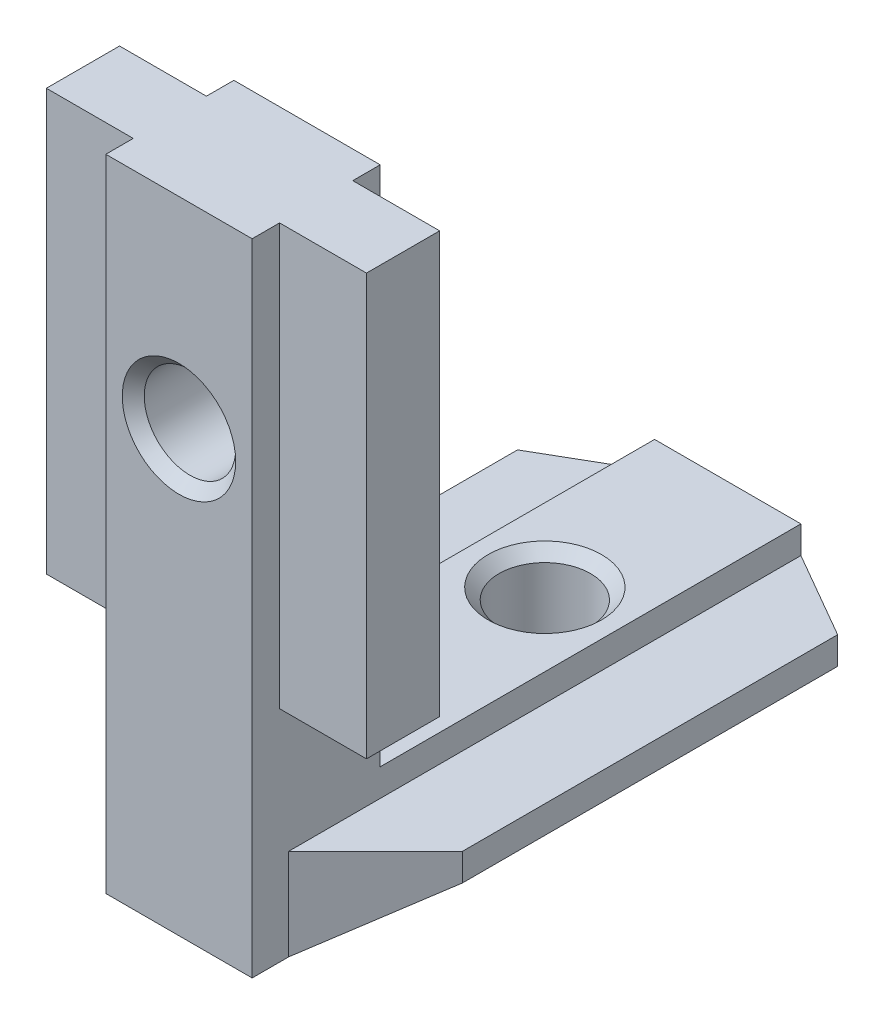
ISO-10303-21;
HEADER;
FILE_DESCRIPTION(('STEP AP214'),'2;1');
FILE_NAME('part.step','',(''),(''),'','','');
FILE_SCHEMA(('AUTOMOTIVE_DESIGN { 1 0 10303 214 1 1 1 1 }'));
ENDSEC;
DATA;
#1=APPLICATION_CONTEXT('core data for automotive mechanical design processes');
#2=APPLICATION_PROTOCOL_DEFINITION('international standard','automotive_design',2000,#1);
#3=PRODUCT_CONTEXT('',#1,'mechanical');
#4=PRODUCT('Part','Part','',(#3));
#5=PRODUCT_RELATED_PRODUCT_CATEGORY('part','',(#4));
#6=PRODUCT_DEFINITION_FORMATION('','',#4);
#7=PRODUCT_DEFINITION_CONTEXT('part definition',#1,'design');
#8=PRODUCT_DEFINITION('design','',#6,#7);
#9=PRODUCT_DEFINITION_SHAPE('','',#8);
#10=(LENGTH_UNIT() NAMED_UNIT(*) SI_UNIT(.MILLI.,.METRE.));
#11=(NAMED_UNIT(*) PLANE_ANGLE_UNIT() SI_UNIT($,.RADIAN.));
#12=(NAMED_UNIT(*) SI_UNIT($,.STERADIAN.) SOLID_ANGLE_UNIT());
#13=UNCERTAINTY_MEASURE_WITH_UNIT(LENGTH_MEASURE(1.E-05),#10,'distance_accuracy_value','');
#14=(GEOMETRIC_REPRESENTATION_CONTEXT(3) GLOBAL_UNCERTAINTY_ASSIGNED_CONTEXT((#13)) GLOBAL_UNIT_ASSIGNED_CONTEXT((#10,
#11,#12)) REPRESENTATION_CONTEXT('',''));
#15=CARTESIAN_POINT('',(0.,0.,0.));
#16=DIRECTION('',(0.,0.,1.));
#17=DIRECTION('',(1.,0.,0.));
#18=AXIS2_PLACEMENT_3D('',#15,#16,#17);
#19=CARTESIAN_POINT('',(4.,0.,30.));
#20=DIRECTION('',(0.,-1.,0.));
#21=DIRECTION('',(0.,0.,-1.));
#22=AXIS2_PLACEMENT_3D('',#19,#20,#21);
#23=PLANE('',#22);
#24=CARTESIAN_POINT('',(0.,0.,10.));
#25=DIRECTION('',(0.,-1.,0.));
#26=DIRECTION('',(0.,0.,-1.));
#27=AXIS2_PLACEMENT_3D('',#24,#25,#26);
#28=CIRCLE('',#27,3.1);
#29=CARTESIAN_POINT('',(0.,0.,6.9));
#30=VERTEX_POINT('',#29);
#31=EDGE_CURVE('E672',#30,#30,#28,.T.);
#32=ORIENTED_EDGE('',*,*,#31,.T.);
#33=EDGE_LOOP('',(#32));
#34=FACE_BOUND('',#33,.T.);
#35=DIRECTION('',(-1.,0.,0.));
#36=VECTOR('',#35,1.);
#37=CARTESIAN_POINT('',(4.,0.,23.));
#38=LINE('',#37,#36);
#39=CARTESIAN_POINT('',(4.,0.,23.));
#40=VERTEX_POINT('',#39);
#41=CARTESIAN_POINT('',(-4.,0.,23.));
#42=VERTEX_POINT('',#41);
#43=EDGE_CURVE('E341',#40,#42,#38,.T.);
#44=ORIENTED_EDGE('',*,*,#43,.F.);
#45=DIRECTION('',(0.,0.,-1.));
#46=VECTOR('',#45,1.);
#47=CARTESIAN_POINT('',(4.,0.,30.));
#48=LINE('',#47,#46);
#49=CARTESIAN_POINT('',(4.,0.,0.));
#50=VERTEX_POINT('',#49);
#51=EDGE_CURVE('E313',#40,#50,#48,.T.);
#52=ORIENTED_EDGE('',*,*,#51,.T.);
#53=DIRECTION('',(-1.,0.,0.));
#54=VECTOR('',#53,1.);
#55=CARTESIAN_POINT('',(4.,0.,0.));
#56=LINE('',#55,#54);
#57=CARTESIAN_POINT('',(-4.,0.,0.));
#58=VERTEX_POINT('',#57);
#59=EDGE_CURVE('E295',#50,#58,#56,.T.);
#60=ORIENTED_EDGE('',*,*,#59,.T.);
#61=DIRECTION('',(0.,0.,-1.));
#62=VECTOR('',#61,1.);
#63=CARTESIAN_POINT('',(-4.,0.,30.));
#64=LINE('',#63,#62);
#65=EDGE_CURVE('E301',#42,#58,#64,.T.);
#66=ORIENTED_EDGE('',*,*,#65,.F.);
#67=EDGE_LOOP('',(#44,#52,#60,#66));
#68=FACE_BOUND('',#67,.T.);
#69=ADVANCED_FACE('F36',(#34,#68),#23,.F.);
#70=CARTESIAN_POINT('',(-4.,0.,30.));
#71=DIRECTION('',(1.,0.,0.));
#72=DIRECTION('',(0.,0.,-1.));
#73=AXIS2_PLACEMENT_3D('',#70,#71,#72);
#74=PLANE('',#73);
#75=DIRECTION('',(0.,0.,1.));
#76=VECTOR('',#75,1.);
#77=CARTESIAN_POINT('',(-4.,28.5,30.));
#78=LINE('',#77,#76);
#79=CARTESIAN_POINT('',(-4.,28.5,28.5));
#80=VERTEX_POINT('',#79);
#81=CARTESIAN_POINT('',(-4.,28.5,30.));
#82=VERTEX_POINT('',#81);
#83=EDGE_CURVE('E283',#80,#82,#78,.T.);
#84=ORIENTED_EDGE('',*,*,#83,.F.);
#85=DIRECTION('',(0.,-1.,0.));
#86=VECTOR('',#85,1.);
#87=CARTESIAN_POINT('',(-4.,0.,28.5));
#88=LINE('',#87,#86);
#89=CARTESIAN_POINT('',(-4.,5.50000000000001,28.5));
#90=VERTEX_POINT('',#89);
#91=EDGE_CURVE('E232',#80,#90,#88,.T.);
#92=ORIENTED_EDGE('',*,*,#91,.T.);
#93=DIRECTION('',(0.,0.,1.));
#94=VECTOR('',#93,1.);
#95=CARTESIAN_POINT('',(-4.,5.50000000000001,30.));
#96=LINE('',#95,#94);
#97=CARTESIAN_POINT('',(-4.,5.50000000000001,24.5));
#98=VERTEX_POINT('',#97);
#99=EDGE_CURVE('E235',#98,#90,#96,.T.);
#100=ORIENTED_EDGE('',*,*,#99,.F.);
#101=DIRECTION('',(0.,1.,0.));
#102=VECTOR('',#101,1.);
#103=CARTESIAN_POINT('',(-4.,0.,24.5));
#104=LINE('',#103,#102);
#105=CARTESIAN_POINT('',(-4.,28.5,24.5));
#106=VERTEX_POINT('',#105);
#107=EDGE_CURVE('E227',#98,#106,#104,.T.);
#108=ORIENTED_EDGE('',*,*,#107,.T.);
#109=CARTESIAN_POINT('',(-4.,28.5,23.));
#110=VERTEX_POINT('',#109);
#111=EDGE_CURVE('E278',#110,#106,#78,.T.);
#112=ORIENTED_EDGE('',*,*,#111,.F.);
#113=DIRECTION('',(0.,1.,0.));
#114=VECTOR('',#113,1.);
#115=CARTESIAN_POINT('',(-4.,28.5,23.));
#116=LINE('',#115,#114);
#117=EDGE_CURVE('E274',#42,#110,#116,.T.);
#118=ORIENTED_EDGE('',*,*,#117,.F.);
#119=ORIENTED_EDGE('',*,*,#65,.T.);
#120=DIRECTION('',(0.,-1.,0.));
#121=VECTOR('',#120,1.);
#122=CARTESIAN_POINT('',(-4.,0.,0.));
#123=LINE('',#122,#121);
#124=CARTESIAN_POINT('',(-4.,-1.5,0.));
#125=VERTEX_POINT('',#124);
#126=EDGE_CURVE('E291',#58,#125,#123,.T.);
#127=ORIENTED_EDGE('',*,*,#126,.T.);
#128=DIRECTION('',(0.,0.,-1.));
#129=VECTOR('',#128,1.);
#130=CARTESIAN_POINT('',(-4.,-1.5,30.));
#131=LINE('',#130,#129);
#132=CARTESIAN_POINT('',(-4.,-1.5,28.));
#133=VERTEX_POINT('',#132);
#134=EDGE_CURVE('E338',#133,#125,#131,.T.);
#135=ORIENTED_EDGE('',*,*,#134,.F.);
#136=DIRECTION('',(0.,1.,0.));
#137=VECTOR('',#136,1.);
#138=CARTESIAN_POINT('',(-4.,-6.5,28.));
#139=LINE('',#138,#137);
#140=CARTESIAN_POINT('',(-4.,-6.5,28.));
#141=VERTEX_POINT('',#140);
#142=EDGE_CURVE('E240',#141,#133,#139,.T.);
#143=ORIENTED_EDGE('',*,*,#142,.F.);
#144=DIRECTION('',(0.,0.,-1.));
#145=VECTOR('',#144,1.);
#146=CARTESIAN_POINT('',(-4.,-6.5,30.));
#147=LINE('',#146,#145);
#148=CARTESIAN_POINT('',(-4.,-6.5,30.));
#149=VERTEX_POINT('',#148);
#150=EDGE_CURVE('E329',#149,#141,#147,.T.);
#151=ORIENTED_EDGE('',*,*,#150,.F.);
#152=DIRECTION('',(0.,-1.,0.));
#153=VECTOR('',#152,1.);
#154=CARTESIAN_POINT('',(-4.,0.,30.));
#155=LINE('',#154,#153);
#156=EDGE_CURVE('E292',#82,#149,#155,.T.);
#157=ORIENTED_EDGE('',*,*,#156,.F.);
#158=EDGE_LOOP('',(#84,#92,#100,#108,#112,#118,#119,#127,#135,#143,#151,#157));
#159=FACE_BOUND('',#158,.T.);
#160=ADVANCED_FACE('F38',(#159),#74,.F.);
#161=CARTESIAN_POINT('',(-4.,-1.5,30.));
#162=DIRECTION('',(0.,-1.,0.));
#163=DIRECTION('',(1.,0.,0.));
#164=AXIS2_PLACEMENT_3D('',#161,#162,#163);
#165=PLANE('',#164);
#166=DIRECTION('',(0.,0.,-1.));
#167=VECTOR('',#166,1.);
#168=CARTESIAN_POINT('',(-8.75,-1.5,30.));
#169=LINE('',#168,#167);
#170=CARTESIAN_POINT('',(-8.75,-1.5,23.25));
#171=VERTEX_POINT('',#170);
#172=CARTESIAN_POINT('',(-8.75,-1.5,2.74241377865068));
#173=VERTEX_POINT('',#172);
#174=EDGE_CURVE('E335',#171,#173,#169,.T.);
#175=ORIENTED_EDGE('',*,*,#174,.F.);
#176=DIRECTION('',(-0.707106781186549,0.,-0.707106781186546));
#177=VECTOR('',#176,1.);
#178=CARTESIAN_POINT('',(-4.,-1.5,28.));
#179=LINE('',#178,#177);
#180=EDGE_CURVE('E238',#133,#171,#179,.T.);
#181=ORIENTED_EDGE('',*,*,#180,.F.);
#182=ORIENTED_EDGE('',*,*,#134,.T.);
#183=DIRECTION('',(0.866025403784442,0.,-0.499999999999995));
#184=VECTOR('',#183,1.);
#185=CARTESIAN_POINT('',(-4.,-1.5,0.));
#186=LINE('',#185,#184);
#187=EDGE_CURVE('E245',#173,#125,#186,.T.);
#188=ORIENTED_EDGE('',*,*,#187,.F.);
#189=EDGE_LOOP('',(#175,#181,#182,#188));
#190=FACE_BOUND('',#189,.T.);
#191=ADVANCED_FACE('F359',(#190),#165,.F.);
#192=CARTESIAN_POINT('',(-8.75,-1.5,30.));
#193=DIRECTION('',(1.,0.,0.));
#194=DIRECTION('',(0.,0.,-1.));
#195=AXIS2_PLACEMENT_3D('',#192,#193,#194);
#196=PLANE('',#195);
#197=DIRECTION('',(0.,0.,-1.));
#198=VECTOR('',#197,1.);
#199=CARTESIAN_POINT('',(-8.75,-3.,30.));
#200=LINE('',#199,#198);
#201=CARTESIAN_POINT('',(-8.75,-3.,23.25));
#202=VERTEX_POINT('',#201);
#203=CARTESIAN_POINT('',(-8.75,-3.,2.74241377865068));
#204=VERTEX_POINT('',#203);
#205=EDGE_CURVE('E332',#202,#204,#200,.T.);
#206=ORIENTED_EDGE('',*,*,#205,.F.);
#207=DIRECTION('',(0.,1.,0.));
#208=VECTOR('',#207,1.);
#209=CARTESIAN_POINT('',(-8.75,-6.5,23.25));
#210=LINE('',#209,#208);
#211=EDGE_CURVE('E242',#202,#171,#210,.T.);
#212=ORIENTED_EDGE('',*,*,#211,.T.);
#213=ORIENTED_EDGE('',*,*,#174,.T.);
#214=DIRECTION('',(0.,1.,0.));
#215=VECTOR('',#214,1.);
#216=CARTESIAN_POINT('',(-8.75,-6.5,2.74241377865068));
#217=LINE('',#216,#215);
#218=EDGE_CURVE('E260',#204,#173,#217,.T.);
#219=ORIENTED_EDGE('',*,*,#218,.F.);
#220=EDGE_LOOP('',(#206,#212,#213,#219));
#221=FACE_BOUND('',#220,.T.);
#222=ADVANCED_FACE('F353',(#221),#196,.F.);
#223=CARTESIAN_POINT('',(-8.75,-3.,30.));
#224=DIRECTION('',(0.59319903804985,0.805055837353368,0.));
#225=DIRECTION('',(-0.805055837353368,0.59319903804985,0.));
#226=AXIS2_PLACEMENT_3D('',#223,#224,#225);
#227=PLANE('',#226);
#228=CARTESIAN_POINT('',(-4.,-6.5,0.));
#229=VERTEX_POINT('',#228);
#230=EDGE_CURVE('E328',#141,#229,#147,.T.);
#231=ORIENTED_EDGE('',*,*,#230,.F.);
#232=DIRECTION('',(-0.627093443885228,0.462068853389115,-0.627093443885226));
#233=VECTOR('',#232,1.);
#234=CARTESIAN_POINT('',(-6.09558823529412,-4.95588235294117,25.9044117647059));
#235=LINE('',#234,#233);
#236=EDGE_CURVE('E44',#141,#202,#235,.T.);
#237=ORIENTED_EDGE('',*,*,#236,.T.);
#238=ORIENTED_EDGE('',*,*,#205,.T.);
#239=DIRECTION('',(0.73004961539945,-0.537931295557489,-0.421494341972649));
#240=VECTOR('',#239,1.);
#241=CARTESIAN_POINT('',(-17.1374804360093,3.18024874232261,7.58492786620328));
#242=LINE('',#241,#240);
#243=EDGE_CURVE('E264',#204,#229,#242,.T.);
#244=ORIENTED_EDGE('',*,*,#243,.T.);
#245=EDGE_LOOP('',(#231,#237,#238,#244));
#246=FACE_BOUND('',#245,.T.);
#247=ADVANCED_FACE('F347',(#246),#227,.F.);
#248=CARTESIAN_POINT('',(-4.,-6.5,30.));
#249=DIRECTION('',(0.,1.,0.));
#250=DIRECTION('',(0.,0.,1.));
#251=AXIS2_PLACEMENT_3D('',#248,#249,#250);
#252=PLANE('',#251);
#253=CARTESIAN_POINT('',(0.,-6.5,10.));
#254=DIRECTION('',(0.,-1.,0.));
#255=DIRECTION('',(0.,0.,-1.));
#256=AXIS2_PLACEMENT_3D('',#253,#254,#255);
#257=CIRCLE('',#256,3.1);
#258=CARTESIAN_POINT('',(0.,-6.5,6.9));
#259=VERTEX_POINT('',#258);
#260=EDGE_CURVE('E674',#259,#259,#257,.T.);
#261=ORIENTED_EDGE('',*,*,#260,.F.);
#262=EDGE_LOOP('',(#261));
#263=FACE_BOUND('',#262,.T.);
#264=ORIENTED_EDGE('',*,*,#150,.T.);
#265=ORIENTED_EDGE('',*,*,#230,.T.);
#266=DIRECTION('',(1.,0.,0.));
#267=VECTOR('',#266,1.);
#268=CARTESIAN_POINT('',(-4.,-6.5,0.));
#269=LINE('',#268,#267);
#270=CARTESIAN_POINT('',(4.,-6.5,0.));
#271=VERTEX_POINT('',#270);
#272=EDGE_CURVE('E304',#229,#271,#269,.T.);
#273=ORIENTED_EDGE('',*,*,#272,.T.);
#274=DIRECTION('',(0.,0.,-1.));
#275=VECTOR('',#274,1.);
#276=CARTESIAN_POINT('',(4.,-6.5,30.));
#277=LINE('',#276,#275);
#278=CARTESIAN_POINT('',(4.,-6.5,28.));
#279=VERTEX_POINT('',#278);
#280=EDGE_CURVE('E324',#279,#271,#277,.T.);
#281=ORIENTED_EDGE('',*,*,#280,.F.);
#282=CARTESIAN_POINT('',(4.,-6.5,30.));
#283=VERTEX_POINT('',#282);
#284=EDGE_CURVE('E325',#283,#279,#277,.T.);
#285=ORIENTED_EDGE('',*,*,#284,.F.);
#286=DIRECTION('',(1.,0.,0.));
#287=VECTOR('',#286,1.);
#288=CARTESIAN_POINT('',(-4.,-6.5,30.));
#289=LINE('',#288,#287);
#290=EDGE_CURVE('E294',#149,#283,#289,.T.);
#291=ORIENTED_EDGE('',*,*,#290,.F.);
#292=EDGE_LOOP('',(#264,#265,#273,#281,#285,#291));
#293=FACE_BOUND('',#292,.T.);
#294=ADVANCED_FACE('F395',(#263,#293),#252,.F.);
#295=CARTESIAN_POINT('',(8.75,-3.,30.));
#296=DIRECTION('',(-0.59319903804985,0.805055837353368,0.));
#297=DIRECTION('',(-0.805055837353368,-0.59319903804985,0.));
#298=AXIS2_PLACEMENT_3D('',#295,#296,#297);
#299=PLANE('',#298);
#300=ORIENTED_EDGE('',*,*,#280,.T.);
#301=DIRECTION('',(0.73004961539945,0.537931295557489,0.421494341972649));
#302=VECTOR('',#301,1.);
#303=CARTESIAN_POINT('',(17.1374804360093,3.18024874232261,7.58492786620327));
#304=LINE('',#303,#302);
#305=CARTESIAN_POINT('',(8.75,-3.,2.74241377865068));
#306=VERTEX_POINT('',#305);
#307=EDGE_CURVE('E268',#271,#306,#304,.T.);
#308=ORIENTED_EDGE('',*,*,#307,.T.);
#309=DIRECTION('',(0.,0.,-1.));
#310=VECTOR('',#309,1.);
#311=CARTESIAN_POINT('',(8.75,-3.,30.));
#312=LINE('',#311,#310);
#313=CARTESIAN_POINT('',(8.75000000000001,-3.,23.25));
#314=VERTEX_POINT('',#313);
#315=EDGE_CURVE('E321',#314,#306,#312,.T.);
#316=ORIENTED_EDGE('',*,*,#315,.F.);
#317=DIRECTION('',(-0.627093443885228,-0.462068853389116,0.627093443885225));
#318=VECTOR('',#317,1.);
#319=CARTESIAN_POINT('',(6.09558823529413,-4.95588235294117,25.9044117647059));
#320=LINE('',#319,#318);
#321=EDGE_CURVE('E271',#314,#279,#320,.T.);
#322=ORIENTED_EDGE('',*,*,#321,.T.);
#323=EDGE_LOOP('',(#300,#308,#316,#322));
#324=FACE_BOUND('',#323,.T.);
#325=ADVANCED_FACE('F391',(#324),#299,.F.);
#326=CARTESIAN_POINT('',(8.75,-1.5,30.));
#327=DIRECTION('',(-1.,0.,0.));
#328=DIRECTION('',(0.,0.,1.));
#329=AXIS2_PLACEMENT_3D('',#326,#327,#328);
#330=PLANE('',#329);
#331=ORIENTED_EDGE('',*,*,#315,.T.);
#332=DIRECTION('',(0.,1.,0.));
#333=VECTOR('',#332,1.);
#334=CARTESIAN_POINT('',(8.75,-6.5,2.74241377865068));
#335=LINE('',#334,#333);
#336=CARTESIAN_POINT('',(8.75,-1.5,2.74241377865068));
#337=VERTEX_POINT('',#336);
#338=EDGE_CURVE('E251',#306,#337,#335,.T.);
#339=ORIENTED_EDGE('',*,*,#338,.T.);
#340=DIRECTION('',(0.,0.,-1.));
#341=VECTOR('',#340,1.);
#342=CARTESIAN_POINT('',(8.75,-1.5,30.));
#343=LINE('',#342,#341);
#344=CARTESIAN_POINT('',(8.75000000000001,-1.5,23.25));
#345=VERTEX_POINT('',#344);
#346=EDGE_CURVE('E318',#345,#337,#343,.T.);
#347=ORIENTED_EDGE('',*,*,#346,.F.);
#348=DIRECTION('',(0.,1.,0.));
#349=VECTOR('',#348,1.);
#350=CARTESIAN_POINT('',(8.75000000000001,-6.5,23.25));
#351=LINE('',#350,#349);
#352=EDGE_CURVE('E250',#314,#345,#351,.T.);
#353=ORIENTED_EDGE('',*,*,#352,.F.);
#354=EDGE_LOOP('',(#331,#339,#347,#353));
#355=FACE_BOUND('',#354,.T.);
#356=ADVANCED_FACE('F386',(#355),#330,.F.);
#357=CARTESIAN_POINT('',(4.,-1.5,30.));
#358=DIRECTION('',(0.,-1.,0.));
#359=DIRECTION('',(1.,0.,0.));
#360=AXIS2_PLACEMENT_3D('',#357,#358,#359);
#361=PLANE('',#360);
#362=ORIENTED_EDGE('',*,*,#346,.T.);
#363=DIRECTION('',(0.866025403784442,0.,0.499999999999994));
#364=VECTOR('',#363,1.);
#365=CARTESIAN_POINT('',(4.,-1.5,0.));
#366=LINE('',#365,#364);
#367=CARTESIAN_POINT('',(4.,-1.5,0.));
#368=VERTEX_POINT('',#367);
#369=EDGE_CURVE('E237',#368,#337,#366,.T.);
#370=ORIENTED_EDGE('',*,*,#369,.F.);
#371=DIRECTION('',(0.,0.,-1.));
#372=VECTOR('',#371,1.);
#373=CARTESIAN_POINT('',(4.,-1.5,30.));
#374=LINE('',#373,#372);
#375=CARTESIAN_POINT('',(4.,-1.5,28.));
#376=VERTEX_POINT('',#375);
#377=EDGE_CURVE('E315',#376,#368,#374,.T.);
#378=ORIENTED_EDGE('',*,*,#377,.F.);
#379=DIRECTION('',(-0.707106781186549,0.,0.707106781186546));
#380=VECTOR('',#379,1.);
#381=CARTESIAN_POINT('',(4.,-1.5,28.));
#382=LINE('',#381,#380);
#383=EDGE_CURVE('E247',#345,#376,#382,.T.);
#384=ORIENTED_EDGE('',*,*,#383,.F.);
#385=EDGE_LOOP('',(#362,#370,#378,#384));
#386=FACE_BOUND('',#385,.T.);
#387=ADVANCED_FACE('F381',(#386),#361,.F.);
#388=CARTESIAN_POINT('',(4.,0.,30.));
#389=DIRECTION('',(-1.,0.,0.));
#390=DIRECTION('',(0.,0.,1.));
#391=AXIS2_PLACEMENT_3D('',#388,#389,#390);
#392=PLANE('',#391);
#393=DIRECTION('',(0.,0.,-1.));
#394=VECTOR('',#393,1.);
#395=CARTESIAN_POINT('',(4.,5.50000000000001,30.));
#396=LINE('',#395,#394);
#397=CARTESIAN_POINT('',(4.,5.50000000000001,28.5));
#398=VERTEX_POINT('',#397);
#399=CARTESIAN_POINT('',(4.,5.50000000000001,24.5));
#400=VERTEX_POINT('',#399);
#401=EDGE_CURVE('E11',#398,#400,#396,.T.);
#402=ORIENTED_EDGE('',*,*,#401,.F.);
#403=DIRECTION('',(0.,1.,0.));
#404=VECTOR('',#403,1.);
#405=CARTESIAN_POINT('',(4.,0.,28.5));
#406=LINE('',#405,#404);
#407=CARTESIAN_POINT('',(4.,28.5,28.5));
#408=VERTEX_POINT('',#407);
#409=EDGE_CURVE('E230',#398,#408,#406,.T.);
#410=ORIENTED_EDGE('',*,*,#409,.T.);
#411=DIRECTION('',(0.,0.,1.));
#412=VECTOR('',#411,1.);
#413=CARTESIAN_POINT('',(4.,28.5,30.));
#414=LINE('',#413,#412);
#415=CARTESIAN_POINT('',(4.,28.5,30.));
#416=VERTEX_POINT('',#415);
#417=EDGE_CURVE('E277',#408,#416,#414,.T.);
#418=ORIENTED_EDGE('',*,*,#417,.T.);
#419=DIRECTION('',(0.,1.,0.));
#420=VECTOR('',#419,1.);
#421=CARTESIAN_POINT('',(4.,0.,30.));
#422=LINE('',#421,#420);
#423=EDGE_CURVE('E298',#283,#416,#422,.T.);
#424=ORIENTED_EDGE('',*,*,#423,.F.);
#425=ORIENTED_EDGE('',*,*,#284,.T.);
#426=DIRECTION('',(0.,1.,0.));
#427=VECTOR('',#426,1.);
#428=CARTESIAN_POINT('',(4.,-6.5,28.));
#429=LINE('',#428,#427);
#430=EDGE_CURVE('E241',#279,#376,#429,.T.);
#431=ORIENTED_EDGE('',*,*,#430,.T.);
#432=ORIENTED_EDGE('',*,*,#377,.T.);
#433=DIRECTION('',(0.,1.,0.));
#434=VECTOR('',#433,1.);
#435=CARTESIAN_POINT('',(4.,0.,0.));
#436=LINE('',#435,#434);
#437=EDGE_CURVE('E307',#368,#50,#436,.T.);
#438=ORIENTED_EDGE('',*,*,#437,.T.);
#439=ORIENTED_EDGE('',*,*,#51,.F.);
#440=DIRECTION('',(0.,1.,0.));
#441=VECTOR('',#440,1.);
#442=CARTESIAN_POINT('',(4.,28.5,23.));
#443=LINE('',#442,#441);
#444=CARTESIAN_POINT('',(4.,28.5,23.));
#445=VERTEX_POINT('',#444);
#446=EDGE_CURVE('E275',#40,#445,#443,.T.);
#447=ORIENTED_EDGE('',*,*,#446,.T.);
#448=CARTESIAN_POINT('',(4.,28.5,24.5));
#449=VERTEX_POINT('',#448);
#450=EDGE_CURVE('E279',#445,#449,#414,.T.);
#451=ORIENTED_EDGE('',*,*,#450,.T.);
#452=DIRECTION('',(0.,-1.,0.));
#453=VECTOR('',#452,1.);
#454=CARTESIAN_POINT('',(4.,0.,24.5));
#455=LINE('',#454,#453);
#456=EDGE_CURVE('E51',#449,#400,#455,.T.);
#457=ORIENTED_EDGE('',*,*,#456,.T.);
#458=EDGE_LOOP('',(#402,#410,#418,#424,#425,#431,#432,#438,#439,#447,#451,#457));
#459=FACE_BOUND('',#458,.T.);
#460=ADVANCED_FACE('F376',(#459),#392,.F.);
#461=CARTESIAN_POINT('',(0.,0.,30.));
#462=DIRECTION('',(0.,0.,-1.));
#463=DIRECTION('',(-1.,0.,0.));
#464=AXIS2_PLACEMENT_3D('',#461,#462,#463);
#465=PLANE('',#464);
#466=CARTESIAN_POINT('',(0.,17.5,30.));
#467=DIRECTION('',(0.,0.,1.));
#468=DIRECTION('',(1.,0.,0.));
#469=AXIS2_PLACEMENT_3D('',#466,#467,#468);
#470=CIRCLE('',#469,3.1);
#471=CARTESIAN_POINT('',(3.1,17.5,30.));
#472=VERTEX_POINT('',#471);
#473=EDGE_CURVE('E662',#472,#472,#470,.T.);
#474=ORIENTED_EDGE('',*,*,#473,.F.);
#475=EDGE_LOOP('',(#474));
#476=FACE_BOUND('',#475,.T.);
#477=ORIENTED_EDGE('',*,*,#290,.T.);
#478=ORIENTED_EDGE('',*,*,#423,.T.);
#479=DIRECTION('',(-1.,0.,0.));
#480=VECTOR('',#479,1.);
#481=CARTESIAN_POINT('',(4.,28.5,30.));
#482=LINE('',#481,#480);
#483=EDGE_CURVE('E281',#416,#82,#482,.T.);
#484=ORIENTED_EDGE('',*,*,#483,.T.);
#485=ORIENTED_EDGE('',*,*,#156,.T.);
#486=EDGE_LOOP('',(#477,#478,#484,#485));
#487=FACE_BOUND('',#486,.T.);
#488=ADVANCED_FACE('F423',(#476,#487),#465,.F.);
#489=CARTESIAN_POINT('',(0.,0.,0.));
#490=DIRECTION('',(0.,0.,-1.));
#491=DIRECTION('',(-1.,0.,0.));
#492=AXIS2_PLACEMENT_3D('',#489,#490,#491);
#493=PLANE('',#492);
#494=DIRECTION('',(0.,1.,0.));
#495=VECTOR('',#494,1.);
#496=CARTESIAN_POINT('',(4.,-6.5,0.));
#497=LINE('',#496,#495);
#498=EDGE_CURVE('E255',#271,#368,#497,.T.);
#499=ORIENTED_EDGE('',*,*,#498,.F.);
#500=ORIENTED_EDGE('',*,*,#272,.F.);
#501=DIRECTION('',(0.,1.,0.));
#502=VECTOR('',#501,1.);
#503=CARTESIAN_POINT('',(-4.,-6.5,0.));
#504=LINE('',#503,#502);
#505=EDGE_CURVE('E261',#229,#125,#504,.T.);
#506=ORIENTED_EDGE('',*,*,#505,.T.);
#507=ORIENTED_EDGE('',*,*,#126,.F.);
#508=ORIENTED_EDGE('',*,*,#59,.F.);
#509=ORIENTED_EDGE('',*,*,#437,.F.);
#510=EDGE_LOOP('',(#499,#500,#506,#507,#508,#509));
#511=FACE_BOUND('',#510,.T.);
#512=ADVANCED_FACE('F367',(#511),#493,.T.);
#513=CARTESIAN_POINT('',(4.,28.5,23.));
#514=DIRECTION('',(0.,0.,1.));
#515=DIRECTION('',(0.,-1.,0.));
#516=AXIS2_PLACEMENT_3D('',#513,#514,#515);
#517=PLANE('',#516);
#518=CARTESIAN_POINT('',(0.,17.5,23.));
#519=DIRECTION('',(0.,0.,1.));
#520=DIRECTION('',(1.,0.,0.));
#521=AXIS2_PLACEMENT_3D('',#518,#519,#520);
#522=CIRCLE('',#521,3.1);
#523=CARTESIAN_POINT('',(3.1,17.5,23.));
#524=VERTEX_POINT('',#523);
#525=EDGE_CURVE('E663',#524,#524,#522,.T.);
#526=ORIENTED_EDGE('',*,*,#525,.T.);
#527=EDGE_LOOP('',(#526));
#528=FACE_BOUND('',#527,.T.);
#529=ORIENTED_EDGE('',*,*,#446,.F.);
#530=ORIENTED_EDGE('',*,*,#43,.T.);
#531=ORIENTED_EDGE('',*,*,#117,.T.);
#532=DIRECTION('',(-1.,0.,0.));
#533=VECTOR('',#532,1.);
#534=CARTESIAN_POINT('',(4.,28.5,23.));
#535=LINE('',#534,#533);
#536=EDGE_CURVE('E288',#445,#110,#535,.T.);
#537=ORIENTED_EDGE('',*,*,#536,.F.);
#538=EDGE_LOOP('',(#529,#530,#531,#537));
#539=FACE_BOUND('',#538,.T.);
#540=ADVANCED_FACE('F485',(#528,#539),#517,.F.);
#541=CARTESIAN_POINT('',(4.,28.5,30.));
#542=DIRECTION('',(0.,-1.,0.));
#543=DIRECTION('',(0.,0.,-1.));
#544=AXIS2_PLACEMENT_3D('',#541,#542,#543);
#545=PLANE('',#544);
#546=ORIENTED_EDGE('',*,*,#111,.T.);
#547=DIRECTION('',(-1.,0.,0.));
#548=VECTOR('',#547,1.);
#549=CARTESIAN_POINT('',(-8.75,28.5,24.5));
#550=LINE('',#549,#548);
#551=CARTESIAN_POINT('',(-8.75,28.5,24.5));
#552=VERTEX_POINT('',#551);
#553=EDGE_CURVE('E216',#106,#552,#550,.T.);
#554=ORIENTED_EDGE('',*,*,#553,.T.);
#555=DIRECTION('',(0.,0.,1.));
#556=VECTOR('',#555,1.);
#557=CARTESIAN_POINT('',(-8.75,28.5,24.5));
#558=LINE('',#557,#556);
#559=CARTESIAN_POINT('',(-8.75,28.5,28.5));
#560=VERTEX_POINT('',#559);
#561=EDGE_CURVE('E218',#552,#560,#558,.T.);
#562=ORIENTED_EDGE('',*,*,#561,.T.);
#563=DIRECTION('',(1.,0.,0.));
#564=VECTOR('',#563,1.);
#565=CARTESIAN_POINT('',(-8.75,28.5,28.5));
#566=LINE('',#565,#564);
#567=EDGE_CURVE('E201',#560,#80,#566,.T.);
#568=ORIENTED_EDGE('',*,*,#567,.T.);
#569=ORIENTED_EDGE('',*,*,#83,.T.);
#570=ORIENTED_EDGE('',*,*,#483,.F.);
#571=ORIENTED_EDGE('',*,*,#417,.F.);
#572=CARTESIAN_POINT('',(8.75000000000001,28.5,28.5));
#573=VERTEX_POINT('',#572);
#574=EDGE_CURVE('E203',#408,#573,#566,.T.);
#575=ORIENTED_EDGE('',*,*,#574,.T.);
#576=DIRECTION('',(0.,0.,-1.));
#577=VECTOR('',#576,1.);
#578=CARTESIAN_POINT('',(8.75000000000001,28.5,24.5));
#579=LINE('',#578,#577);
#580=CARTESIAN_POINT('',(8.75000000000001,28.5,24.5));
#581=VERTEX_POINT('',#580);
#582=EDGE_CURVE('E214',#573,#581,#579,.T.);
#583=ORIENTED_EDGE('',*,*,#582,.T.);
#584=EDGE_CURVE('E181',#581,#449,#550,.T.);
#585=ORIENTED_EDGE('',*,*,#584,.T.);
#586=ORIENTED_EDGE('',*,*,#450,.F.);
#587=ORIENTED_EDGE('',*,*,#536,.T.);
#588=EDGE_LOOP('',(#546,#554,#562,#568,#569,#570,#571,#575,#583,#585,#586,#587));
#589=FACE_BOUND('',#588,.T.);
#590=ADVANCED_FACE('F491',(#589),#545,.F.);
#591=CARTESIAN_POINT('',(-4.,-6.5,0.));
#592=DIRECTION('',(0.499999999999995,0.,0.866025403784442));
#593=DIRECTION('',(0.866025403784442,0.,-0.499999999999995));
#594=AXIS2_PLACEMENT_3D('',#591,#592,#593);
#595=PLANE('',#594);
#596=ORIENTED_EDGE('',*,*,#218,.T.);
#597=ORIENTED_EDGE('',*,*,#187,.T.);
#598=ORIENTED_EDGE('',*,*,#505,.F.);
#599=ORIENTED_EDGE('',*,*,#243,.F.);
#600=EDGE_LOOP('',(#596,#597,#598,#599));
#601=FACE_BOUND('',#600,.T.);
#602=ADVANCED_FACE('F357',(#601),#595,.F.);
#603=CARTESIAN_POINT('',(4.,-6.5,0.));
#604=DIRECTION('',(-0.499999999999994,0.,0.866025403784442));
#605=DIRECTION('',(0.866025403784442,0.,0.499999999999994));
#606=AXIS2_PLACEMENT_3D('',#603,#604,#605);
#607=PLANE('',#606);
#608=ORIENTED_EDGE('',*,*,#498,.T.);
#609=ORIENTED_EDGE('',*,*,#369,.T.);
#610=ORIENTED_EDGE('',*,*,#338,.F.);
#611=ORIENTED_EDGE('',*,*,#307,.F.);
#612=EDGE_LOOP('',(#608,#609,#610,#611));
#613=FACE_BOUND('',#612,.T.);
#614=ADVANCED_FACE('F384',(#613),#607,.F.);
#615=CARTESIAN_POINT('',(-4.,-6.5,28.));
#616=DIRECTION('',(0.707106781186546,0.,-0.707106781186549));
#617=DIRECTION('',(-0.707106781186549,0.,-0.707106781186546));
#618=AXIS2_PLACEMENT_3D('',#615,#616,#617);
#619=PLANE('',#618);
#620=ORIENTED_EDGE('',*,*,#142,.T.);
#621=ORIENTED_EDGE('',*,*,#180,.T.);
#622=ORIENTED_EDGE('',*,*,#211,.F.);
#623=ORIENTED_EDGE('',*,*,#236,.F.);
#624=EDGE_LOOP('',(#620,#621,#622,#623));
#625=FACE_BOUND('',#624,.T.);
#626=ADVANCED_FACE('F399',(#625),#619,.F.);
#627=CARTESIAN_POINT('',(4.,-6.5,28.));
#628=DIRECTION('',(-0.707106781186546,0.,-0.707106781186549));
#629=DIRECTION('',(-0.707106781186549,0.,0.707106781186546));
#630=AXIS2_PLACEMENT_3D('',#627,#628,#629);
#631=PLANE('',#630);
#632=ORIENTED_EDGE('',*,*,#352,.T.);
#633=ORIENTED_EDGE('',*,*,#383,.T.);
#634=ORIENTED_EDGE('',*,*,#430,.F.);
#635=ORIENTED_EDGE('',*,*,#321,.F.);
#636=EDGE_LOOP('',(#632,#633,#634,#635));
#637=FACE_BOUND('',#636,.T.);
#638=ADVANCED_FACE('F401',(#637),#631,.F.);
#639=CARTESIAN_POINT('',(8.75000000000001,5.50000000000001,24.5));
#640=DIRECTION('',(1.,0.,0.));
#641=DIRECTION('',(0.,0.,-1.));
#642=AXIS2_PLACEMENT_3D('',#639,#640,#641);
#643=PLANE('',#642);
#644=ORIENTED_EDGE('',*,*,#582,.F.);
#645=DIRECTION('',(0.,1.,0.));
#646=VECTOR('',#645,1.);
#647=CARTESIAN_POINT('',(8.75000000000001,5.50000000000001,28.5));
#648=LINE('',#647,#646);
#649=CARTESIAN_POINT('',(8.75000000000001,5.50000000000001,28.5));
#650=VERTEX_POINT('',#649);
#651=EDGE_CURVE('E200',#650,#573,#648,.T.);
#652=ORIENTED_EDGE('',*,*,#651,.F.);
#653=DIRECTION('',(0.,0.,-1.));
#654=VECTOR('',#653,1.);
#655=CARTESIAN_POINT('',(8.75000000000001,5.50000000000001,24.5));
#656=LINE('',#655,#654);
#657=CARTESIAN_POINT('',(8.75000000000001,5.50000000000001,24.5));
#658=VERTEX_POINT('',#657);
#659=EDGE_CURVE('E193',#650,#658,#656,.T.);
#660=ORIENTED_EDGE('',*,*,#659,.T.);
#661=DIRECTION('',(0.,1.,0.));
#662=VECTOR('',#661,1.);
#663=CARTESIAN_POINT('',(8.75000000000001,5.50000000000001,24.5));
#664=LINE('',#663,#662);
#665=EDGE_CURVE('E176',#658,#581,#664,.T.);
#666=ORIENTED_EDGE('',*,*,#665,.T.);
#667=EDGE_LOOP('',(#644,#652,#660,#666));
#668=FACE_BOUND('',#667,.T.);
#669=ADVANCED_FACE('F198',(#668),#643,.T.);
#670=CARTESIAN_POINT('',(0.,5.50000000000001,0.));
#671=DIRECTION('',(0.,1.,0.));
#672=DIRECTION('',(0.,0.,1.));
#673=AXIS2_PLACEMENT_3D('',#670,#671,#672);
#674=PLANE('',#673);
#675=DIRECTION('',(1.,0.,0.));
#676=VECTOR('',#675,1.);
#677=CARTESIAN_POINT('',(-8.75,5.50000000000001,28.5));
#678=LINE('',#677,#676);
#679=EDGE_CURVE('E211',#398,#650,#678,.T.);
#680=ORIENTED_EDGE('',*,*,#679,.F.);
#681=ORIENTED_EDGE('',*,*,#401,.T.);
#682=DIRECTION('',(-1.,0.,0.));
#683=VECTOR('',#682,1.);
#684=CARTESIAN_POINT('',(-8.75,5.50000000000001,24.5));
#685=LINE('',#684,#683);
#686=EDGE_CURVE('E179',#658,#400,#685,.T.);
#687=ORIENTED_EDGE('',*,*,#686,.F.);
#688=ORIENTED_EDGE('',*,*,#659,.F.);
#689=EDGE_LOOP('',(#680,#681,#687,#688));
#690=FACE_BOUND('',#689,.T.);
#691=ADVANCED_FACE('F192',(#690),#674,.F.);
#692=CARTESIAN_POINT('',(-8.75,5.50000000000001,24.5));
#693=DIRECTION('',(0.,0.,-1.));
#694=DIRECTION('',(-1.,0.,0.));
#695=AXIS2_PLACEMENT_3D('',#692,#693,#694);
#696=PLANE('',#695);
#697=ORIENTED_EDGE('',*,*,#456,.F.);
#698=ORIENTED_EDGE('',*,*,#584,.F.);
#699=ORIENTED_EDGE('',*,*,#665,.F.);
#700=ORIENTED_EDGE('',*,*,#686,.T.);
#701=EDGE_LOOP('',(#697,#698,#699,#700));
#702=FACE_BOUND('',#701,.T.);
#703=ADVANCED_FACE('F178',(#702),#696,.T.);
#704=CARTESIAN_POINT('',(-8.75,5.50000000000001,28.5));
#705=DIRECTION('',(0.,0.,1.));
#706=DIRECTION('',(1.,0.,0.));
#707=AXIS2_PLACEMENT_3D('',#704,#705,#706);
#708=PLANE('',#707);
#709=ORIENTED_EDGE('',*,*,#409,.F.);
#710=ORIENTED_EDGE('',*,*,#679,.T.);
#711=ORIENTED_EDGE('',*,*,#651,.T.);
#712=ORIENTED_EDGE('',*,*,#574,.F.);
#713=EDGE_LOOP('',(#709,#710,#711,#712));
#714=FACE_BOUND('',#713,.T.);
#715=ADVANCED_FACE('F591',(#714),#708,.T.);
#716=CARTESIAN_POINT('',(-8.75,5.50000000000001,24.5));
#717=VERTEX_POINT('',#716);
#718=EDGE_CURVE('E195',#98,#717,#685,.T.);
#719=ORIENTED_EDGE('',*,*,#718,.F.);
#720=ORIENTED_EDGE('',*,*,#99,.T.);
#721=CARTESIAN_POINT('',(-8.75,5.50000000000001,28.5));
#722=VERTEX_POINT('',#721);
#723=EDGE_CURVE('E187',#722,#90,#678,.T.);
#724=ORIENTED_EDGE('',*,*,#723,.F.);
#725=DIRECTION('',(0.,0.,1.));
#726=VECTOR('',#725,1.);
#727=CARTESIAN_POINT('',(-8.75,5.50000000000001,24.5));
#728=LINE('',#727,#726);
#729=EDGE_CURVE('E194',#717,#722,#728,.T.);
#730=ORIENTED_EDGE('',*,*,#729,.F.);
#731=EDGE_LOOP('',(#719,#720,#724,#730));
#732=FACE_BOUND('',#731,.T.);
#733=ADVANCED_FACE('F588',(#732),#674,.F.);
#734=ORIENTED_EDGE('',*,*,#91,.F.);
#735=ORIENTED_EDGE('',*,*,#567,.F.);
#736=DIRECTION('',(0.,1.,0.));
#737=VECTOR('',#736,1.);
#738=CARTESIAN_POINT('',(-8.75,5.50000000000001,28.5));
#739=LINE('',#738,#737);
#740=EDGE_CURVE('E222',#722,#560,#739,.T.);
#741=ORIENTED_EDGE('',*,*,#740,.F.);
#742=ORIENTED_EDGE('',*,*,#723,.T.);
#743=EDGE_LOOP('',(#734,#735,#741,#742));
#744=FACE_BOUND('',#743,.T.);
#745=ADVANCED_FACE('F578',(#744),#708,.T.);
#746=ORIENTED_EDGE('',*,*,#107,.F.);
#747=ORIENTED_EDGE('',*,*,#718,.T.);
#748=DIRECTION('',(0.,1.,0.));
#749=VECTOR('',#748,1.);
#750=CARTESIAN_POINT('',(-8.75,5.50000000000001,24.5));
#751=LINE('',#750,#749);
#752=EDGE_CURVE('E186',#717,#552,#751,.T.);
#753=ORIENTED_EDGE('',*,*,#752,.T.);
#754=ORIENTED_EDGE('',*,*,#553,.F.);
#755=EDGE_LOOP('',(#746,#747,#753,#754));
#756=FACE_BOUND('',#755,.T.);
#757=ADVANCED_FACE('F566',(#756),#696,.T.);
#758=CARTESIAN_POINT('',(-8.75,5.50000000000001,24.5));
#759=DIRECTION('',(-1.,0.,0.));
#760=DIRECTION('',(0.,0.,1.));
#761=AXIS2_PLACEMENT_3D('',#758,#759,#760);
#762=PLANE('',#761);
#763=ORIENTED_EDGE('',*,*,#561,.F.);
#764=ORIENTED_EDGE('',*,*,#752,.F.);
#765=ORIENTED_EDGE('',*,*,#729,.T.);
#766=ORIENTED_EDGE('',*,*,#740,.T.);
#767=EDGE_LOOP('',(#763,#764,#765,#766));
#768=FACE_BOUND('',#767,.T.);
#769=ADVANCED_FACE('F560',(#768),#762,.T.);
#770=CARTESIAN_POINT('',(0.,-0.600000000000004,10.));
#771=DIRECTION('',(0.,1.,0.));
#772=DIRECTION('',(0.,0.,1.));
#773=AXIS2_PLACEMENT_3D('',#770,#771,#772);
#774=CONICAL_SURFACE('',#773,2.5,0.785398163397446);
#775=ORIENTED_EDGE('',*,*,#31,.F.);
#776=EDGE_LOOP('',(#775));
#777=FACE_BOUND('',#776,.T.);
#778=CARTESIAN_POINT('',(0.,-0.600000000000004,10.));
#779=DIRECTION('',(0.,-1.,0.));
#780=DIRECTION('',(0.,0.,-1.));
#781=AXIS2_PLACEMENT_3D('',#778,#779,#780);
#782=CIRCLE('',#781,2.5);
#783=CARTESIAN_POINT('',(0.,-0.600000000000004,7.5));
#784=VERTEX_POINT('',#783);
#785=EDGE_CURVE('E206',#784,#784,#782,.T.);
#786=ORIENTED_EDGE('',*,*,#785,.T.);
#787=EDGE_LOOP('',(#786));
#788=FACE_BOUND('',#787,.T.);
#789=ADVANCED_FACE('F565',(#777,#788),#774,.F.);
#790=CARTESIAN_POINT('',(0.,-6.5,10.));
#791=DIRECTION('',(0.,-1.,0.));
#792=DIRECTION('',(0.,0.,-1.));
#793=AXIS2_PLACEMENT_3D('',#790,#791,#792);
#794=CYLINDRICAL_SURFACE('',#793,2.5);
#795=ORIENTED_EDGE('',*,*,#785,.F.);
#796=EDGE_LOOP('',(#795));
#797=FACE_BOUND('',#796,.T.);
#798=CARTESIAN_POINT('',(0.,-5.9,10.));
#799=DIRECTION('',(0.,-1.,0.));
#800=DIRECTION('',(0.,0.,-1.));
#801=AXIS2_PLACEMENT_3D('',#798,#799,#800);
#802=CIRCLE('',#801,2.5);
#803=CARTESIAN_POINT('',(0.,-5.9,7.5));
#804=VERTEX_POINT('',#803);
#805=EDGE_CURVE('E676',#804,#804,#802,.T.);
#806=ORIENTED_EDGE('',*,*,#805,.T.);
#807=EDGE_LOOP('',(#806));
#808=FACE_BOUND('',#807,.T.);
#809=ADVANCED_FACE('F634',(#797,#808),#794,.F.);
#810=CARTESIAN_POINT('',(0.,-6.5,10.));
#811=DIRECTION('',(0.,-1.,0.));
#812=DIRECTION('',(0.,0.,-1.));
#813=AXIS2_PLACEMENT_3D('',#810,#811,#812);
#814=CONICAL_SURFACE('',#813,3.1,0.785398163397449);
#815=ORIENTED_EDGE('',*,*,#805,.F.);
#816=EDGE_LOOP('',(#815));
#817=FACE_BOUND('',#816,.T.);
#818=ORIENTED_EDGE('',*,*,#260,.T.);
#819=EDGE_LOOP('',(#818));
#820=FACE_BOUND('',#819,.T.);
#821=ADVANCED_FACE('F638',(#817,#820),#814,.F.);
#822=CARTESIAN_POINT('',(0.,17.5,23.6));
#823=DIRECTION('',(0.,0.,-1.));
#824=DIRECTION('',(-1.,0.,0.));
#825=AXIS2_PLACEMENT_3D('',#822,#823,#824);
#826=CONICAL_SURFACE('',#825,2.5,0.785398163397445);
#827=ORIENTED_EDGE('',*,*,#525,.F.);
#828=EDGE_LOOP('',(#827));
#829=FACE_BOUND('',#828,.T.);
#830=CARTESIAN_POINT('',(0.,17.5,23.6));
#831=DIRECTION('',(0.,0.,1.));
#832=DIRECTION('',(1.,0.,0.));
#833=AXIS2_PLACEMENT_3D('',#830,#831,#832);
#834=CIRCLE('',#833,2.5);
#835=CARTESIAN_POINT('',(2.5,17.5,23.6));
#836=VERTEX_POINT('',#835);
#837=EDGE_CURVE('E665',#836,#836,#834,.T.);
#838=ORIENTED_EDGE('',*,*,#837,.T.);
#839=EDGE_LOOP('',(#838));
#840=FACE_BOUND('',#839,.T.);
#841=ADVANCED_FACE('F642',(#829,#840),#826,.F.);
#842=CARTESIAN_POINT('',(0.,17.5,30.));
#843=DIRECTION('',(0.,0.,1.));
#844=DIRECTION('',(1.,0.,0.));
#845=AXIS2_PLACEMENT_3D('',#842,#843,#844);
#846=CYLINDRICAL_SURFACE('',#845,2.49999999999999);
#847=ORIENTED_EDGE('',*,*,#837,.F.);
#848=EDGE_LOOP('',(#847));
#849=FACE_BOUND('',#848,.T.);
#850=CARTESIAN_POINT('',(0.,17.5,29.4));
#851=DIRECTION('',(0.,0.,1.));
#852=DIRECTION('',(1.,0.,0.));
#853=AXIS2_PLACEMENT_3D('',#850,#851,#852);
#854=CIRCLE('',#853,2.49999999999999);
#855=CARTESIAN_POINT('',(2.49999999999999,17.5,29.4));
#856=VERTEX_POINT('',#855);
#857=EDGE_CURVE('E659',#856,#856,#854,.T.);
#858=ORIENTED_EDGE('',*,*,#857,.T.);
#859=EDGE_LOOP('',(#858));
#860=FACE_BOUND('',#859,.T.);
#861=ADVANCED_FACE('F646',(#849,#860),#846,.F.);
#862=CARTESIAN_POINT('',(0.,17.5,30.));
#863=DIRECTION('',(0.,0.,1.));
#864=DIRECTION('',(1.,0.,0.));
#865=AXIS2_PLACEMENT_3D('',#862,#863,#864);
#866=CONICAL_SURFACE('',#865,3.1,0.785398163397441);
#867=ORIENTED_EDGE('',*,*,#857,.F.);
#868=EDGE_LOOP('',(#867));
#869=FACE_BOUND('',#868,.T.);
#870=ORIENTED_EDGE('',*,*,#473,.T.);
#871=EDGE_LOOP('',(#870));
#872=FACE_BOUND('',#871,.T.);
#873=ADVANCED_FACE('F650',(#869,#872),#866,.F.);
#874=CLOSED_SHELL('',(#69,#160,#191,#222,#247,#294,#325,#356,#387,#460,#488,#512,#540,#590,#602,
#614,#626,#638,#669,#691,#703,#715,#733,#745,#757,#769,#789,#809,#821,#841,#861,#873));
#875=MANIFOLD_SOLID_BREP('B2',#874);
#876=ADVANCED_BREP_SHAPE_REPRESENTATION('',(#18,#875),#14);
#877=SHAPE_DEFINITION_REPRESENTATION(#9,#876);
ENDSEC;
END-ISO-10303-21;
